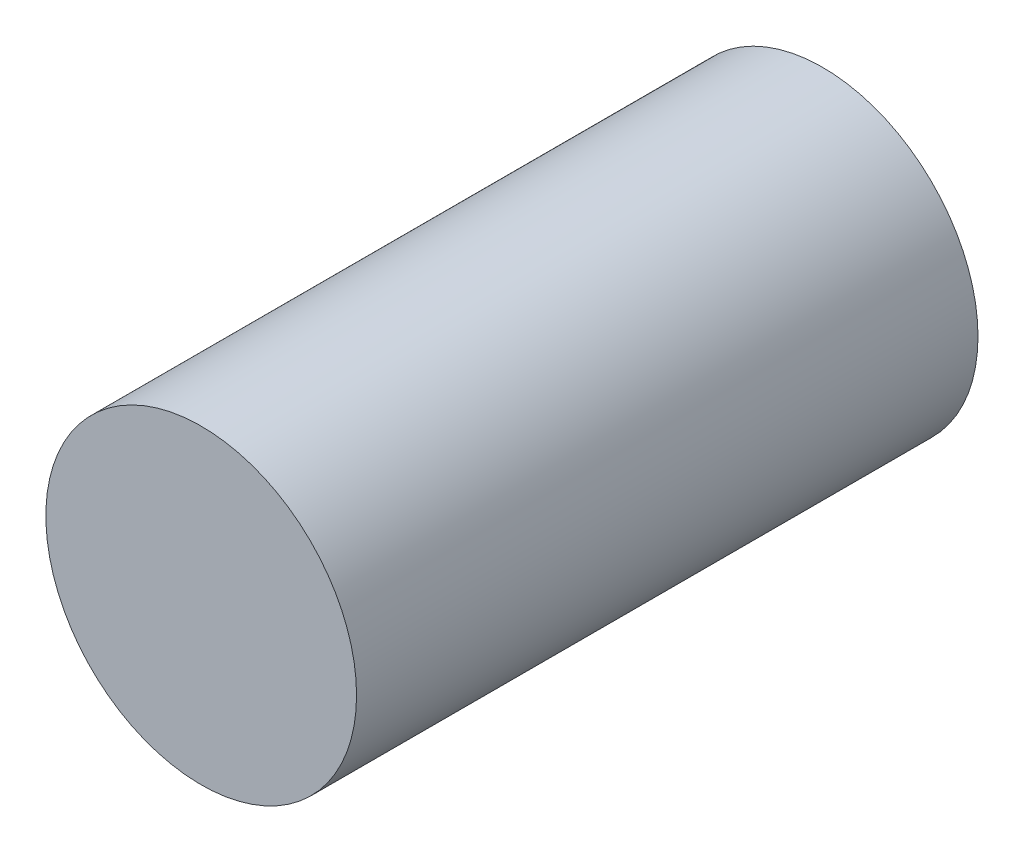
ISO-10303-21;
HEADER;
FILE_DESCRIPTION(('STEP AP214'),'2;1');
FILE_NAME('part.step','',(''),(''),'','','');
FILE_SCHEMA(('AUTOMOTIVE_DESIGN { 1 0 10303 214 1 1 1 1 }'));
ENDSEC;
DATA;
#1=APPLICATION_CONTEXT('core data for automotive mechanical design processes');
#2=APPLICATION_PROTOCOL_DEFINITION('international standard','automotive_design',2000,#1);
#3=PRODUCT_CONTEXT('',#1,'mechanical');
#4=PRODUCT('Part','Part','',(#3));
#5=PRODUCT_RELATED_PRODUCT_CATEGORY('part','',(#4));
#6=PRODUCT_DEFINITION_FORMATION('','',#4);
#7=PRODUCT_DEFINITION_CONTEXT('part definition',#1,'design');
#8=PRODUCT_DEFINITION('design','',#6,#7);
#9=PRODUCT_DEFINITION_SHAPE('','',#8);
#10=(LENGTH_UNIT() NAMED_UNIT(*) SI_UNIT(.MILLI.,.METRE.));
#11=(NAMED_UNIT(*) PLANE_ANGLE_UNIT() SI_UNIT($,.RADIAN.));
#12=(NAMED_UNIT(*) SI_UNIT($,.STERADIAN.) SOLID_ANGLE_UNIT());
#13=UNCERTAINTY_MEASURE_WITH_UNIT(LENGTH_MEASURE(1.E-05),#10,'distance_accuracy_value','');
#14=(GEOMETRIC_REPRESENTATION_CONTEXT(3) GLOBAL_UNCERTAINTY_ASSIGNED_CONTEXT((#13)) GLOBAL_UNIT_ASSIGNED_CONTEXT((#10,
#11,#12)) REPRESENTATION_CONTEXT('',''));
#15=CARTESIAN_POINT('',(0.,0.,0.));
#16=DIRECTION('',(0.,0.,1.));
#17=DIRECTION('',(1.,0.,0.));
#18=AXIS2_PLACEMENT_3D('',#15,#16,#17);
#19=CARTESIAN_POINT('',(0.,0.,80.));
#20=DIRECTION('',(0.,0.,-1.));
#21=DIRECTION('',(-1.,0.,0.));
#22=AXIS2_PLACEMENT_3D('',#19,#20,#21);
#23=CYLINDRICAL_SURFACE('',#22,20.);
#24=CARTESIAN_POINT('',(0.,0.,80.));
#25=DIRECTION('',(0.,0.,1.));
#26=DIRECTION('',(1.,0.,0.));
#27=AXIS2_PLACEMENT_3D('',#24,#25,#26);
#28=CIRCLE('',#27,20.);
#29=CARTESIAN_POINT('',(20.,0.,80.));
#30=VERTEX_POINT('',#29);
#31=EDGE_CURVE('E10',#30,#30,#28,.T.);
#32=ORIENTED_EDGE('',*,*,#31,.F.);
#33=EDGE_LOOP('',(#32));
#34=FACE_BOUND('',#33,.T.);
#35=CARTESIAN_POINT('',(0.,0.,0.));
#36=DIRECTION('',(0.,0.,1.));
#37=DIRECTION('',(1.,0.,0.));
#38=AXIS2_PLACEMENT_3D('',#35,#36,#37);
#39=CIRCLE('',#38,20.);
#40=CARTESIAN_POINT('',(20.,0.,0.));
#41=VERTEX_POINT('',#40);
#42=EDGE_CURVE('E34',#41,#41,#39,.T.);
#43=ORIENTED_EDGE('',*,*,#42,.T.);
#44=EDGE_LOOP('',(#43));
#45=FACE_BOUND('',#44,.T.);
#46=ADVANCED_FACE('F31',(#34,#45),#23,.T.);
#47=CARTESIAN_POINT('',(0.,0.,80.));
#48=DIRECTION('',(0.,0.,1.));
#49=DIRECTION('',(1.,0.,0.));
#50=AXIS2_PLACEMENT_3D('',#47,#48,#49);
#51=PLANE('',#50);
#52=ORIENTED_EDGE('',*,*,#31,.T.);
#53=EDGE_LOOP('',(#52));
#54=FACE_BOUND('',#53,.T.);
#55=ADVANCED_FACE('F46',(#54),#51,.T.);
#56=CARTESIAN_POINT('',(0.,0.,0.));
#57=DIRECTION('',(0.,0.,1.));
#58=DIRECTION('',(1.,0.,0.));
#59=AXIS2_PLACEMENT_3D('',#56,#57,#58);
#60=PLANE('',#59);
#61=ORIENTED_EDGE('',*,*,#42,.F.);
#62=EDGE_LOOP('',(#61));
#63=FACE_BOUND('',#62,.T.);
#64=ADVANCED_FACE('F44',(#63),#60,.F.);
#65=CLOSED_SHELL('',(#46,#55,#64));
#66=MANIFOLD_SOLID_BREP('B2',#65);
#67=ADVANCED_BREP_SHAPE_REPRESENTATION('',(#18,#66),#14);
#68=SHAPE_DEFINITION_REPRESENTATION(#9,#67);
ENDSEC;
END-ISO-10303-21;
